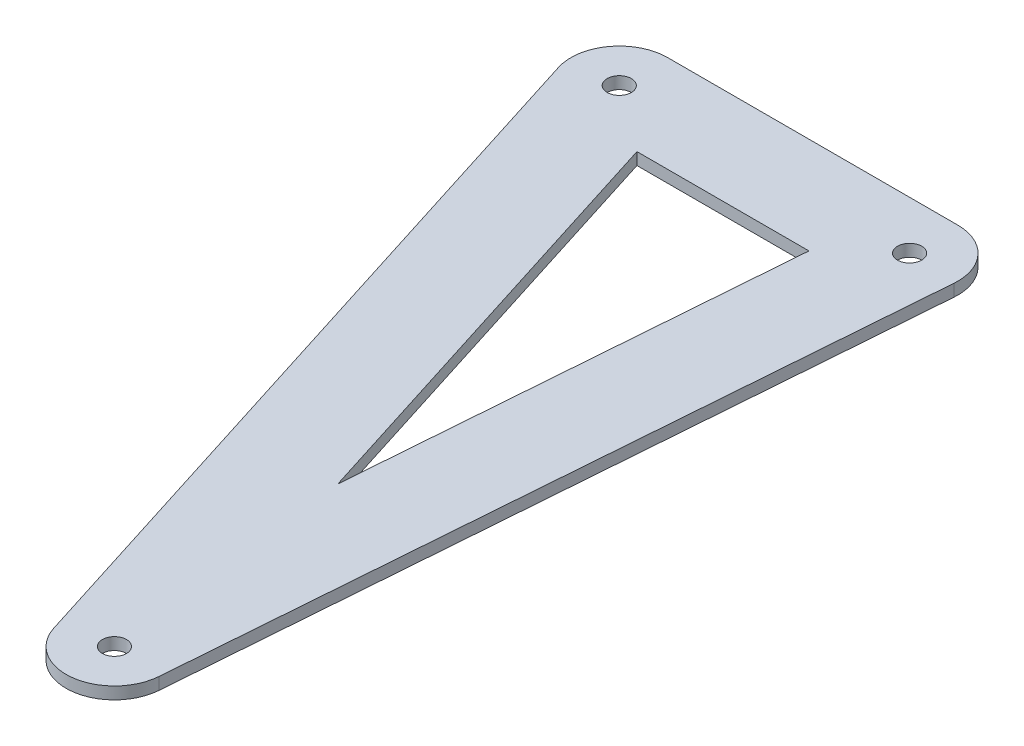
ISO-10303-21;
HEADER;
FILE_DESCRIPTION(('STEP AP214'),'2;1');
FILE_NAME('part.step','',(''),(''),'','','');
FILE_SCHEMA(('AUTOMOTIVE_DESIGN { 1 0 10303 214 1 1 1 1 }'));
ENDSEC;
DATA;
#1=APPLICATION_CONTEXT('core data for automotive mechanical design processes');
#2=APPLICATION_PROTOCOL_DEFINITION('international standard','automotive_design',2000,#1);
#3=PRODUCT_CONTEXT('',#1,'mechanical');
#4=PRODUCT('Part','Part','',(#3));
#5=PRODUCT_RELATED_PRODUCT_CATEGORY('part','',(#4));
#6=PRODUCT_DEFINITION_FORMATION('','',#4);
#7=PRODUCT_DEFINITION_CONTEXT('part definition',#1,'design');
#8=PRODUCT_DEFINITION('design','',#6,#7);
#9=PRODUCT_DEFINITION_SHAPE('','',#8);
#10=(LENGTH_UNIT() NAMED_UNIT(*) SI_UNIT(.MILLI.,.METRE.));
#11=(NAMED_UNIT(*) PLANE_ANGLE_UNIT() SI_UNIT($,.RADIAN.));
#12=(NAMED_UNIT(*) SI_UNIT($,.STERADIAN.) SOLID_ANGLE_UNIT());
#13=UNCERTAINTY_MEASURE_WITH_UNIT(LENGTH_MEASURE(1.E-05),#10,'distance_accuracy_value','');
#14=(GEOMETRIC_REPRESENTATION_CONTEXT(3) GLOBAL_UNCERTAINTY_ASSIGNED_CONTEXT((#13)) GLOBAL_UNIT_ASSIGNED_CONTEXT((#10,
#11,#12)) REPRESENTATION_CONTEXT('',''));
#15=CARTESIAN_POINT('',(0.,0.,0.));
#16=DIRECTION('',(0.,0.,1.));
#17=DIRECTION('',(1.,0.,0.));
#18=AXIS2_PLACEMENT_3D('',#15,#16,#17);
#19=CARTESIAN_POINT('',(88.4113421717857,3.175,6.82206997484308));
#20=DIRECTION('',(0.997036176936115,0.,0.0769341398900157));
#21=DIRECTION('',(0.0769341398900157,0.,-0.997036176936115));
#22=AXIS2_PLACEMENT_3D('',#19,#20,#21);
#23=PLANE('',#22);
#24=DIRECTION('',(-0.0769341398900157,0.,0.997036176936115));
#25=VECTOR('',#24,1.);
#26=CARTESIAN_POINT('',(88.4113421717857,0.,6.82206997484308));
#27=LINE('',#26,#25);
#28=CARTESIAN_POINT('',(88.8623594470887,0.,0.977063576603199));
#29=VERTEX_POINT('',#28);
#30=CARTESIAN_POINT('',(73.9121308904076,0.,194.726142279293));
#31=VERTEX_POINT('',#30);
#32=EDGE_CURVE('E173',#29,#31,#27,.T.);
#33=ORIENTED_EDGE('',*,*,#32,.F.);
#34=DIRECTION('',(0.,-1.,0.));
#35=VECTOR('',#34,1.);
#36=CARTESIAN_POINT('',(88.8623594470887,3.175,0.977063576603199));
#37=LINE('',#36,#35);
#38=CARTESIAN_POINT('',(88.8623594470887,3.175,0.977063576603199));
#39=VERTEX_POINT('',#38);
#40=EDGE_CURVE('E11',#39,#29,#37,.T.);
#41=ORIENTED_EDGE('',*,*,#40,.F.);
#42=DIRECTION('',(-0.0769341398900157,0.,0.997036176936115));
#43=VECTOR('',#42,1.);
#44=CARTESIAN_POINT('',(88.4113421717857,3.175,6.82206997484308));
#45=LINE('',#44,#43);
#46=CARTESIAN_POINT('',(73.9121308904076,3.175,194.726142279293));
#47=VERTEX_POINT('',#46);
#48=EDGE_CURVE('E194',#39,#47,#45,.T.);
#49=ORIENTED_EDGE('',*,*,#48,.T.);
#50=DIRECTION('',(0.,-1.,0.));
#51=VECTOR('',#50,1.);
#52=CARTESIAN_POINT('',(73.9121308904076,3.175,194.726142279293));
#53=LINE('',#52,#51);
#54=EDGE_CURVE('E91',#47,#31,#53,.T.);
#55=ORIENTED_EDGE('',*,*,#54,.T.);
#56=EDGE_LOOP('',(#33,#41,#49,#55));
#57=FACE_BOUND('',#56,.T.);
#58=ADVANCED_FACE('F35',(#57),#23,.T.);
#59=CARTESIAN_POINT('',(76.2,3.175,0.));
#60=DIRECTION('',(0.,-1.,0.));
#61=DIRECTION('',(0.,0.,-1.));
#62=AXIS2_PLACEMENT_3D('',#59,#60,#61);
#63=CYLINDRICAL_SURFACE('',#62,12.7);
#64=CARTESIAN_POINT('',(76.2,0.,0.));
#65=DIRECTION('',(0.,1.,0.));
#66=DIRECTION('',(0.,0.,1.));
#67=AXIS2_PLACEMENT_3D('',#64,#65,#66);
#68=CIRCLE('',#67,12.7);
#69=CARTESIAN_POINT('',(76.2,0.,-12.7));
#70=VERTEX_POINT('',#69);
#71=EDGE_CURVE('E170',#29,#70,#68,.T.);
#72=ORIENTED_EDGE('',*,*,#71,.T.);
#73=DIRECTION('',(0.,-1.,0.));
#74=VECTOR('',#73,1.);
#75=CARTESIAN_POINT('',(76.2,3.175,-12.7));
#76=LINE('',#75,#74);
#77=CARTESIAN_POINT('',(76.2,3.175,-12.7));
#78=VERTEX_POINT('',#77);
#79=EDGE_CURVE('E45',#78,#70,#76,.T.);
#80=ORIENTED_EDGE('',*,*,#79,.F.);
#81=CARTESIAN_POINT('',(76.2,3.175,0.));
#82=DIRECTION('',(0.,1.,0.));
#83=DIRECTION('',(0.,0.,1.));
#84=AXIS2_PLACEMENT_3D('',#81,#82,#83);
#85=CIRCLE('',#84,12.7);
#86=EDGE_CURVE('E192',#39,#78,#85,.T.);
#87=ORIENTED_EDGE('',*,*,#86,.F.);
#88=ORIENTED_EDGE('',*,*,#40,.T.);
#89=EDGE_LOOP('',(#72,#80,#87,#88));
#90=FACE_BOUND('',#89,.T.);
#91=ADVANCED_FACE('F226',(#90),#63,.T.);
#92=CARTESIAN_POINT('',(0.,3.175,-12.7));
#93=DIRECTION('',(0.,0.,-1.));
#94=DIRECTION('',(-1.,0.,0.));
#95=AXIS2_PLACEMENT_3D('',#92,#93,#94);
#96=PLANE('',#95);
#97=DIRECTION('',(1.,0.,0.));
#98=VECTOR('',#97,1.);
#99=CARTESIAN_POINT('',(0.,0.,-12.7));
#100=LINE('',#99,#98);
#101=CARTESIAN_POINT('',(0.,0.,-12.7));
#102=VERTEX_POINT('',#101);
#103=EDGE_CURVE('E167',#102,#70,#100,.T.);
#104=ORIENTED_EDGE('',*,*,#103,.F.);
#105=DIRECTION('',(0.,-1.,0.));
#106=VECTOR('',#105,1.);
#107=CARTESIAN_POINT('',(0.,3.175,-12.7));
#108=LINE('',#107,#106);
#109=CARTESIAN_POINT('',(0.,3.175,-12.7));
#110=VERTEX_POINT('',#109);
#111=EDGE_CURVE('E139',#110,#102,#108,.T.);
#112=ORIENTED_EDGE('',*,*,#111,.F.);
#113=DIRECTION('',(1.,0.,0.));
#114=VECTOR('',#113,1.);
#115=CARTESIAN_POINT('',(0.,3.175,-12.7));
#116=LINE('',#115,#114);
#117=EDGE_CURVE('E133',#110,#78,#116,.T.);
#118=ORIENTED_EDGE('',*,*,#117,.T.);
#119=ORIENTED_EDGE('',*,*,#79,.T.);
#120=EDGE_LOOP('',(#104,#112,#118,#119));
#121=FACE_BOUND('',#120,.T.);
#122=ADVANCED_FACE('F231',(#121),#96,.T.);
#123=CARTESIAN_POINT('',(0.,3.175,0.));
#124=DIRECTION('',(0.,-1.,0.));
#125=DIRECTION('',(0.,0.,-1.));
#126=AXIS2_PLACEMENT_3D('',#123,#124,#125);
#127=CYLINDRICAL_SURFACE('',#126,12.7);
#128=CARTESIAN_POINT('',(0.,0.,0.));
#129=DIRECTION('',(0.,1.,0.));
#130=DIRECTION('',(0.,0.,1.));
#131=AXIS2_PLACEMENT_3D('',#128,#129,#130);
#132=CIRCLE('',#131,12.7);
#133=CARTESIAN_POINT('',(-12.1093174189181,0.,3.82811071520744));
#134=VERTEX_POINT('',#133);
#135=EDGE_CURVE('E138',#102,#134,#132,.T.);
#136=ORIENTED_EDGE('',*,*,#135,.T.);
#137=DIRECTION('',(0.,-1.,0.));
#138=VECTOR('',#137,1.);
#139=CARTESIAN_POINT('',(-12.1093174189181,3.175,3.82811071520744));
#140=LINE('',#139,#138);
#141=CARTESIAN_POINT('',(-12.1093174189181,3.175,3.82811071520744));
#142=VERTEX_POINT('',#141);
#143=EDGE_CURVE('E123',#142,#134,#140,.T.);
#144=ORIENTED_EDGE('',*,*,#143,.F.);
#145=CARTESIAN_POINT('',(0.,3.175,0.));
#146=DIRECTION('',(0.,1.,0.));
#147=DIRECTION('',(0.,0.,1.));
#148=AXIS2_PLACEMENT_3D('',#145,#146,#147);
#149=CIRCLE('',#148,12.7);
#150=EDGE_CURVE('E126',#110,#142,#149,.T.);
#151=ORIENTED_EDGE('',*,*,#150,.F.);
#152=ORIENTED_EDGE('',*,*,#111,.T.);
#153=EDGE_LOOP('',(#136,#144,#151,#152));
#154=FACE_BOUND('',#153,.T.);
#155=ADVANCED_FACE('F136',(#154),#127,.T.);
#156=CARTESIAN_POINT('',(-12.1093174189181,3.175,3.82811071520744));
#157=DIRECTION('',(0.953489560544735,0.,-0.301426040567514));
#158=DIRECTION('',(-0.301426040567514,0.,-0.953489560544735));
#159=AXIS2_PLACEMENT_3D('',#156,#157,#158);
#160=PLANE('',#159);
#161=DIRECTION('',(0.301426040567514,0.,0.953489560544735));
#162=VECTOR('',#161,1.);
#163=CARTESIAN_POINT('',(-12.1093174189181,0.,3.82811071520744));
#164=LINE('',#163,#162);
#165=CARTESIAN_POINT('',(49.1404540244008,0.,197.577189417897));
#166=VERTEX_POINT('',#165);
#167=EDGE_CURVE('E164',#134,#166,#164,.T.);
#168=ORIENTED_EDGE('',*,*,#167,.T.);
#169=DIRECTION('',(0.,-1.,0.));
#170=VECTOR('',#169,1.);
#171=CARTESIAN_POINT('',(49.1404540244008,3.175,197.577189417897));
#172=LINE('',#171,#170);
#173=CARTESIAN_POINT('',(49.1404540244008,3.175,197.577189417897));
#174=VERTEX_POINT('',#173);
#175=EDGE_CURVE('E125',#174,#166,#172,.T.);
#176=ORIENTED_EDGE('',*,*,#175,.F.);
#177=DIRECTION('',(0.301426040567514,0.,0.953489560544735));
#178=VECTOR('',#177,1.);
#179=CARTESIAN_POINT('',(-12.1093174189181,3.175,3.82811071520744));
#180=LINE('',#179,#178);
#181=EDGE_CURVE('E118',#142,#174,#180,.T.);
#182=ORIENTED_EDGE('',*,*,#181,.F.);
#183=ORIENTED_EDGE('',*,*,#143,.T.);
#184=EDGE_LOOP('',(#168,#176,#182,#183));
#185=FACE_BOUND('',#184,.T.);
#186=ADVANCED_FACE('F121',(#185),#160,.F.);
#187=CARTESIAN_POINT('',(0.,3.175,12.7));
#188=DIRECTION('',(0.,0.,-1.));
#189=DIRECTION('',(-1.,0.,0.));
#190=AXIS2_PLACEMENT_3D('',#187,#188,#189);
#191=PLANE('',#190);
#192=DIRECTION('',(1.,0.,0.));
#193=VECTOR('',#192,1.);
#194=CARTESIAN_POINT('',(0.,0.,12.7));
#195=LINE('',#194,#193);
#196=CARTESIAN_POINT('',(17.3343384124361,0.,12.7));
#197=VERTEX_POINT('',#196);
#198=CARTESIAN_POINT('',(62.4822795270752,0.,12.7));
#199=VERTEX_POINT('',#198);
#200=EDGE_CURVE('E183',#197,#199,#195,.T.);
#201=ORIENTED_EDGE('',*,*,#200,.T.);
#202=DIRECTION('',(0.,-1.,0.));
#203=VECTOR('',#202,1.);
#204=CARTESIAN_POINT('',(62.4822795270752,3.175,12.7));
#205=LINE('',#204,#203);
#206=CARTESIAN_POINT('',(62.4822795270752,3.175,12.7));
#207=VERTEX_POINT('',#206);
#208=EDGE_CURVE('E39',#207,#199,#205,.T.);
#209=ORIENTED_EDGE('',*,*,#208,.F.);
#210=DIRECTION('',(1.,0.,0.));
#211=VECTOR('',#210,1.);
#212=CARTESIAN_POINT('',(0.,3.175,12.7));
#213=LINE('',#212,#211);
#214=CARTESIAN_POINT('',(17.3343384124361,3.175,12.7));
#215=VERTEX_POINT('',#214);
#216=EDGE_CURVE('E159',#215,#207,#213,.T.);
#217=ORIENTED_EDGE('',*,*,#216,.F.);
#218=DIRECTION('',(0.,-1.,0.));
#219=VECTOR('',#218,1.);
#220=CARTESIAN_POINT('',(17.3343384124361,3.175,12.7));
#221=LINE('',#220,#219);
#222=EDGE_CURVE('E146',#215,#197,#221,.T.);
#223=ORIENTED_EDGE('',*,*,#222,.T.);
#224=EDGE_LOOP('',(#201,#209,#217,#223));
#225=FACE_BOUND('',#224,.T.);
#226=ADVANCED_FACE('F37',(#225),#191,.F.);
#227=CARTESIAN_POINT('',(63.0866232776083,3.175,4.86794282163668));
#228=DIRECTION('',(0.997036176936115,0.,0.0769341398900156));
#229=DIRECTION('',(0.0769341398900156,0.,-0.997036176936115));
#230=AXIS2_PLACEMENT_3D('',#227,#228,#229);
#231=PLANE('',#230);
#232=DIRECTION('',(-0.0769341398900156,0.,0.997036176936115));
#233=VECTOR('',#232,1.);
#234=CARTESIAN_POINT('',(63.0866232776083,0.,4.86794282163668));
#235=LINE('',#234,#233);
#236=CARTESIAN_POINT('',(53.6243787589987,0.,127.494908087725));
#237=VERTEX_POINT('',#236);
#238=EDGE_CURVE('E181',#199,#237,#235,.T.);
#239=ORIENTED_EDGE('',*,*,#238,.T.);
#240=DIRECTION('',(0.,-1.,0.));
#241=VECTOR('',#240,1.);
#242=CARTESIAN_POINT('',(53.6243787589987,3.175,127.494908087725));
#243=LINE('',#242,#241);
#244=CARTESIAN_POINT('',(53.6243787589987,3.175,127.494908087725));
#245=VERTEX_POINT('',#244);
#246=EDGE_CURVE('E147',#245,#237,#243,.T.);
#247=ORIENTED_EDGE('',*,*,#246,.F.);
#248=DIRECTION('',(-0.0769341398900156,0.,0.997036176936115));
#249=VECTOR('',#248,1.);
#250=CARTESIAN_POINT('',(63.0866232776083,3.175,4.86794282163668));
#251=LINE('',#250,#249);
#252=EDGE_CURVE('E99',#207,#245,#251,.T.);
#253=ORIENTED_EDGE('',*,*,#252,.F.);
#254=ORIENTED_EDGE('',*,*,#208,.T.);
#255=EDGE_LOOP('',(#239,#247,#253,#254));
#256=FACE_BOUND('',#255,.T.);
#257=ADVANCED_FACE('F247',(#256),#231,.F.);
#258=CARTESIAN_POINT('',(61.2497714433189,3.175,193.74907870269));
#259=DIRECTION('',(0.,-1.,0.));
#260=DIRECTION('',(0.,0.,-1.));
#261=AXIS2_PLACEMENT_3D('',#258,#259,#260);
#262=CYLINDRICAL_SURFACE('',#261,3.175);
#263=CARTESIAN_POINT('',(61.2497714433189,3.175,193.74907870269));
#264=DIRECTION('',(0.,1.,0.));
#265=DIRECTION('',(0.,0.,1.));
#266=AXIS2_PLACEMENT_3D('',#263,#264,#265);
#267=CIRCLE('',#266,3.175);
#268=CARTESIAN_POINT('',(61.2497714433189,3.175,196.92407870269));
#269=VERTEX_POINT('',#268);
#270=EDGE_CURVE('E187',#269,#269,#267,.T.);
#271=ORIENTED_EDGE('',*,*,#270,.T.);
#272=EDGE_LOOP('',(#271));
#273=FACE_BOUND('',#272,.T.);
#274=CARTESIAN_POINT('',(61.2497714433189,0.,193.74907870269));
#275=DIRECTION('',(0.,1.,0.));
#276=DIRECTION('',(0.,0.,1.));
#277=AXIS2_PLACEMENT_3D('',#274,#275,#276);
#278=CIRCLE('',#277,3.175);
#279=CARTESIAN_POINT('',(61.2497714433189,0.,196.92407870269));
#280=VERTEX_POINT('',#279);
#281=EDGE_CURVE('E160',#280,#280,#278,.T.);
#282=ORIENTED_EDGE('',*,*,#281,.F.);
#283=EDGE_LOOP('',(#282));
#284=FACE_BOUND('',#283,.T.);
#285=ADVANCED_FACE('F244',(#273,#284),#262,.F.);
#286=CARTESIAN_POINT('',(61.2497714433189,3.175,193.74907870269));
#287=DIRECTION('',(0.,-1.,0.));
#288=DIRECTION('',(0.,0.,-1.));
#289=AXIS2_PLACEMENT_3D('',#286,#287,#288);
#290=CYLINDRICAL_SURFACE('',#289,12.7);
#291=CARTESIAN_POINT('',(61.2497714433189,0.,193.74907870269));
#292=DIRECTION('',(0.,1.,0.));
#293=DIRECTION('',(0.,0.,1.));
#294=AXIS2_PLACEMENT_3D('',#291,#292,#293);
#295=CIRCLE('',#294,12.7);
#296=EDGE_CURVE('E84',#166,#31,#295,.T.);
#297=ORIENTED_EDGE('',*,*,#296,.T.);
#298=ORIENTED_EDGE('',*,*,#54,.F.);
#299=CARTESIAN_POINT('',(61.2497714433189,3.175,193.74907870269));
#300=DIRECTION('',(0.,1.,0.));
#301=DIRECTION('',(0.,0.,1.));
#302=AXIS2_PLACEMENT_3D('',#299,#300,#301);
#303=CIRCLE('',#302,12.7);
#304=EDGE_CURVE('E54',#174,#47,#303,.T.);
#305=ORIENTED_EDGE('',*,*,#304,.F.);
#306=ORIENTED_EDGE('',*,*,#175,.T.);
#307=EDGE_LOOP('',(#297,#298,#305,#306));
#308=FACE_BOUND('',#307,.T.);
#309=ADVANCED_FACE('F222',(#308),#290,.T.);
#310=CARTESIAN_POINT('',(76.2,3.175,0.));
#311=DIRECTION('',(0.,-1.,0.));
#312=DIRECTION('',(0.,0.,-1.));
#313=AXIS2_PLACEMENT_3D('',#310,#311,#312);
#314=CYLINDRICAL_SURFACE('',#313,3.175);
#315=CARTESIAN_POINT('',(76.2,3.175,0.));
#316=DIRECTION('',(0.,1.,0.));
#317=DIRECTION('',(0.,0.,1.));
#318=AXIS2_PLACEMENT_3D('',#315,#316,#317);
#319=CIRCLE('',#318,3.175);
#320=CARTESIAN_POINT('',(76.2,3.175,3.175));
#321=VERTEX_POINT('',#320);
#322=EDGE_CURVE('E196',#321,#321,#319,.T.);
#323=ORIENTED_EDGE('',*,*,#322,.T.);
#324=EDGE_LOOP('',(#323));
#325=FACE_BOUND('',#324,.T.);
#326=CARTESIAN_POINT('',(76.2,0.,0.));
#327=DIRECTION('',(0.,1.,0.));
#328=DIRECTION('',(0.,0.,1.));
#329=AXIS2_PLACEMENT_3D('',#326,#327,#328);
#330=CIRCLE('',#329,3.175);
#331=CARTESIAN_POINT('',(76.2,0.,3.175));
#332=VERTEX_POINT('',#331);
#333=EDGE_CURVE('E175',#332,#332,#330,.T.);
#334=ORIENTED_EDGE('',*,*,#333,.F.);
#335=EDGE_LOOP('',(#334));
#336=FACE_BOUND('',#335,.T.);
#337=ADVANCED_FACE('F214',(#325,#336),#314,.F.);
#338=CARTESIAN_POINT('',(12.1093174189181,3.175,-3.82811071520744));
#339=DIRECTION('',(0.953489560544735,0.,-0.301426040567514));
#340=DIRECTION('',(-0.301426040567515,0.,-0.953489560544735));
#341=AXIS2_PLACEMENT_3D('',#338,#339,#340);
#342=PLANE('',#341);
#343=DIRECTION('',(0.301426040567515,0.,0.953489560544735));
#344=VECTOR('',#343,1.);
#345=CARTESIAN_POINT('',(12.1093174189181,0.,-3.82811071520744));
#346=LINE('',#345,#344);
#347=EDGE_CURVE('E178',#197,#237,#346,.T.);
#348=ORIENTED_EDGE('',*,*,#347,.F.);
#349=ORIENTED_EDGE('',*,*,#222,.F.);
#350=DIRECTION('',(0.301426040567515,0.,0.953489560544735));
#351=VECTOR('',#350,1.);
#352=CARTESIAN_POINT('',(12.1093174189181,3.175,-3.82811071520744));
#353=LINE('',#352,#351);
#354=EDGE_CURVE('E199',#215,#245,#353,.T.);
#355=ORIENTED_EDGE('',*,*,#354,.T.);
#356=ORIENTED_EDGE('',*,*,#246,.T.);
#357=EDGE_LOOP('',(#348,#349,#355,#356));
#358=FACE_BOUND('',#357,.T.);
#359=ADVANCED_FACE('F211',(#358),#342,.T.);
#360=CARTESIAN_POINT('',(0.,3.175,0.));
#361=DIRECTION('',(0.,-1.,0.));
#362=DIRECTION('',(0.,0.,-1.));
#363=AXIS2_PLACEMENT_3D('',#360,#361,#362);
#364=CYLINDRICAL_SURFACE('',#363,3.175);
#365=CARTESIAN_POINT('',(0.,3.175,0.));
#366=DIRECTION('',(0.,1.,0.));
#367=DIRECTION('',(0.,0.,1.));
#368=AXIS2_PLACEMENT_3D('',#365,#366,#367);
#369=CIRCLE('',#368,3.175);
#370=CARTESIAN_POINT('',(0.,3.175,3.175));
#371=VERTEX_POINT('',#370);
#372=EDGE_CURVE('E148',#371,#371,#369,.T.);
#373=ORIENTED_EDGE('',*,*,#372,.T.);
#374=EDGE_LOOP('',(#373));
#375=FACE_BOUND('',#374,.T.);
#376=CARTESIAN_POINT('',(0.,0.,0.));
#377=DIRECTION('',(0.,1.,0.));
#378=DIRECTION('',(0.,0.,1.));
#379=AXIS2_PLACEMENT_3D('',#376,#377,#378);
#380=CIRCLE('',#379,3.175);
#381=CARTESIAN_POINT('',(0.,0.,3.175));
#382=VERTEX_POINT('',#381);
#383=EDGE_CURVE('E156',#382,#382,#380,.T.);
#384=ORIENTED_EDGE('',*,*,#383,.F.);
#385=EDGE_LOOP('',(#384));
#386=FACE_BOUND('',#385,.T.);
#387=ADVANCED_FACE('F213',(#375,#386),#364,.F.);
#388=CARTESIAN_POINT('',(0.,3.175,0.));
#389=DIRECTION('',(0.,1.,0.));
#390=DIRECTION('',(0.,0.,1.));
#391=AXIS2_PLACEMENT_3D('',#388,#389,#390);
#392=PLANE('',#391);
#393=ORIENTED_EDGE('',*,*,#216,.T.);
#394=ORIENTED_EDGE('',*,*,#252,.T.);
#395=ORIENTED_EDGE('',*,*,#354,.F.);
#396=EDGE_LOOP('',(#393,#394,#395));
#397=FACE_BOUND('',#396,.T.);
#398=ORIENTED_EDGE('',*,*,#322,.F.);
#399=EDGE_LOOP('',(#398));
#400=FACE_BOUND('',#399,.T.);
#401=ORIENTED_EDGE('',*,*,#48,.F.);
#402=ORIENTED_EDGE('',*,*,#86,.T.);
#403=ORIENTED_EDGE('',*,*,#117,.F.);
#404=ORIENTED_EDGE('',*,*,#150,.T.);
#405=ORIENTED_EDGE('',*,*,#181,.T.);
#406=ORIENTED_EDGE('',*,*,#304,.T.);
#407=EDGE_LOOP('',(#401,#402,#403,#404,#405,#406));
#408=FACE_BOUND('',#407,.T.);
#409=ORIENTED_EDGE('',*,*,#270,.F.);
#410=EDGE_LOOP('',(#409));
#411=FACE_BOUND('',#410,.T.);
#412=ORIENTED_EDGE('',*,*,#372,.F.);
#413=EDGE_LOOP('',(#412));
#414=FACE_BOUND('',#413,.T.);
#415=ADVANCED_FACE('F130',(#397,#400,#408,#411,#414),#392,.T.);
#416=CARTESIAN_POINT('',(0.,0.,0.));
#417=DIRECTION('',(0.,1.,0.));
#418=DIRECTION('',(0.,0.,1.));
#419=AXIS2_PLACEMENT_3D('',#416,#417,#418);
#420=PLANE('',#419);
#421=ORIENTED_EDGE('',*,*,#200,.F.);
#422=ORIENTED_EDGE('',*,*,#347,.T.);
#423=ORIENTED_EDGE('',*,*,#238,.F.);
#424=EDGE_LOOP('',(#421,#422,#423));
#425=FACE_BOUND('',#424,.T.);
#426=ORIENTED_EDGE('',*,*,#333,.T.);
#427=EDGE_LOOP('',(#426));
#428=FACE_BOUND('',#427,.T.);
#429=ORIENTED_EDGE('',*,*,#32,.T.);
#430=ORIENTED_EDGE('',*,*,#296,.F.);
#431=ORIENTED_EDGE('',*,*,#167,.F.);
#432=ORIENTED_EDGE('',*,*,#135,.F.);
#433=ORIENTED_EDGE('',*,*,#103,.T.);
#434=ORIENTED_EDGE('',*,*,#71,.F.);
#435=EDGE_LOOP('',(#429,#430,#431,#432,#433,#434));
#436=FACE_BOUND('',#435,.T.);
#437=ORIENTED_EDGE('',*,*,#281,.T.);
#438=EDGE_LOOP('',(#437));
#439=FACE_BOUND('',#438,.T.);
#440=ORIENTED_EDGE('',*,*,#383,.T.);
#441=EDGE_LOOP('',(#440));
#442=FACE_BOUND('',#441,.T.);
#443=ADVANCED_FACE('F209',(#425,#428,#436,#439,#442),#420,.F.);
#444=CLOSED_SHELL('',(#58,#91,#122,#155,#186,#226,#257,#285,#309,#337,#359,#387,#415,#443));
#445=MANIFOLD_SOLID_BREP('B2',#444);
#446=ADVANCED_BREP_SHAPE_REPRESENTATION('',(#18,#445),#14);
#447=SHAPE_DEFINITION_REPRESENTATION(#9,#446);
ENDSEC;
END-ISO-10303-21;
